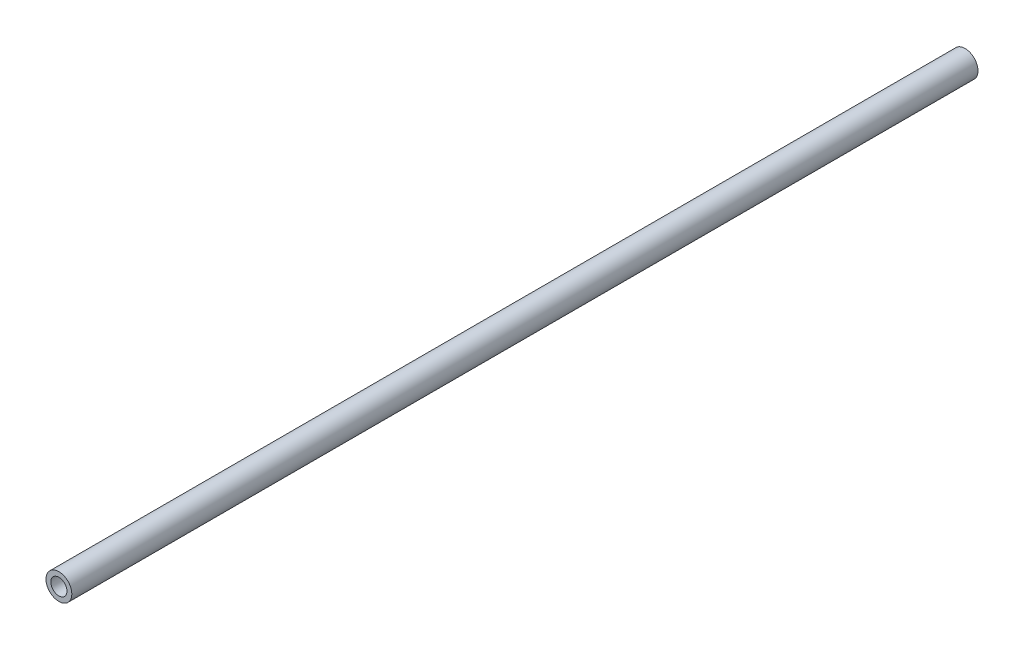
ISO-10303-21;
HEADER;
FILE_DESCRIPTION(('STEP AP214'),'2;1');
FILE_NAME('part.step','',(''),(''),'','','');
FILE_SCHEMA(('AUTOMOTIVE_DESIGN { 1 0 10303 214 1 1 1 1 }'));
ENDSEC;
DATA;
#1=APPLICATION_CONTEXT('core data for automotive mechanical design processes');
#2=APPLICATION_PROTOCOL_DEFINITION('international standard','automotive_design',2000,#1);
#3=PRODUCT_CONTEXT('',#1,'mechanical');
#4=PRODUCT('Part','Part','',(#3));
#5=PRODUCT_RELATED_PRODUCT_CATEGORY('part','',(#4));
#6=PRODUCT_DEFINITION_FORMATION('','',#4);
#7=PRODUCT_DEFINITION_CONTEXT('part definition',#1,'design');
#8=PRODUCT_DEFINITION('design','',#6,#7);
#9=PRODUCT_DEFINITION_SHAPE('','',#8);
#10=(LENGTH_UNIT() NAMED_UNIT(*) SI_UNIT(.MILLI.,.METRE.));
#11=(NAMED_UNIT(*) PLANE_ANGLE_UNIT() SI_UNIT($,.RADIAN.));
#12=(NAMED_UNIT(*) SI_UNIT($,.STERADIAN.) SOLID_ANGLE_UNIT());
#13=UNCERTAINTY_MEASURE_WITH_UNIT(LENGTH_MEASURE(1.E-05),#10,'distance_accuracy_value','');
#14=(GEOMETRIC_REPRESENTATION_CONTEXT(3) GLOBAL_UNCERTAINTY_ASSIGNED_CONTEXT((#13)) GLOBAL_UNIT_ASSIGNED_CONTEXT((#10,
#11,#12)) REPRESENTATION_CONTEXT('',''));
#15=CARTESIAN_POINT('',(0.,0.,0.));
#16=DIRECTION('',(0.,0.,1.));
#17=DIRECTION('',(1.,0.,0.));
#18=AXIS2_PLACEMENT_3D('',#15,#16,#17);
#19=CARTESIAN_POINT('',(0.,0.,-600.));
#20=DIRECTION('',(0.,0.,1.));
#21=DIRECTION('',(1.,0.,0.));
#22=AXIS2_PLACEMENT_3D('',#19,#20,#21);
#23=CYLINDRICAL_SURFACE('',#22,8.55);
#24=CARTESIAN_POINT('',(0.,0.,-600.));
#25=DIRECTION('',(0.,0.,1.));
#26=DIRECTION('',(1.,0.,0.));
#27=AXIS2_PLACEMENT_3D('',#24,#25,#26);
#28=CIRCLE('',#27,8.55);
#29=CARTESIAN_POINT('',(8.55,0.,-600.));
#30=VERTEX_POINT('',#29);
#31=EDGE_CURVE('E10',#30,#30,#28,.T.);
#32=ORIENTED_EDGE('',*,*,#31,.T.);
#33=EDGE_LOOP('',(#32));
#34=FACE_BOUND('',#33,.T.);
#35=CARTESIAN_POINT('',(0.,0.,0.));
#36=DIRECTION('',(0.,0.,1.));
#37=DIRECTION('',(1.,0.,0.));
#38=AXIS2_PLACEMENT_3D('',#35,#36,#37);
#39=CIRCLE('',#38,8.55);
#40=CARTESIAN_POINT('',(8.55,0.,0.));
#41=VERTEX_POINT('',#40);
#42=EDGE_CURVE('E35',#41,#41,#39,.T.);
#43=ORIENTED_EDGE('',*,*,#42,.F.);
#44=EDGE_LOOP('',(#43));
#45=FACE_BOUND('',#44,.T.);
#46=ADVANCED_FACE('F32',(#34,#45),#23,.T.);
#47=CARTESIAN_POINT('',(0.,0.,-600.));
#48=DIRECTION('',(0.,0.,1.));
#49=DIRECTION('',(1.,0.,0.));
#50=AXIS2_PLACEMENT_3D('',#47,#48,#49);
#51=PLANE('',#50);
#52=CARTESIAN_POINT('',(0.,0.,-600.));
#53=DIRECTION('',(0.,0.,1.));
#54=DIRECTION('',(1.,0.,0.));
#55=AXIS2_PLACEMENT_3D('',#52,#53,#54);
#56=CIRCLE('',#55,5.35);
#57=CARTESIAN_POINT('',(5.35,0.,-600.));
#58=VERTEX_POINT('',#57);
#59=EDGE_CURVE('E42',#58,#58,#56,.T.);
#60=ORIENTED_EDGE('',*,*,#59,.T.);
#61=EDGE_LOOP('',(#60));
#62=FACE_BOUND('',#61,.T.);
#63=ORIENTED_EDGE('',*,*,#31,.F.);
#64=EDGE_LOOP('',(#63));
#65=FACE_BOUND('',#64,.T.);
#66=ADVANCED_FACE('F50',(#62,#65),#51,.F.);
#67=CARTESIAN_POINT('',(0.,0.,0.));
#68=DIRECTION('',(0.,0.,1.));
#69=DIRECTION('',(1.,0.,0.));
#70=AXIS2_PLACEMENT_3D('',#67,#68,#69);
#71=PLANE('',#70);
#72=CARTESIAN_POINT('',(0.,0.,0.));
#73=DIRECTION('',(0.,0.,1.));
#74=DIRECTION('',(1.,0.,0.));
#75=AXIS2_PLACEMENT_3D('',#72,#73,#74);
#76=CIRCLE('',#75,5.35);
#77=CARTESIAN_POINT('',(5.35,0.,0.));
#78=VERTEX_POINT('',#77);
#79=EDGE_CURVE('E44',#78,#78,#76,.T.);
#80=ORIENTED_EDGE('',*,*,#79,.F.);
#81=EDGE_LOOP('',(#80));
#82=FACE_BOUND('',#81,.T.);
#83=ORIENTED_EDGE('',*,*,#42,.T.);
#84=EDGE_LOOP('',(#83));
#85=FACE_BOUND('',#84,.T.);
#86=ADVANCED_FACE('F56',(#82,#85),#71,.T.);
#87=CARTESIAN_POINT('',(0.,0.,-600.));
#88=DIRECTION('',(0.,0.,1.));
#89=DIRECTION('',(1.,0.,0.));
#90=AXIS2_PLACEMENT_3D('',#87,#88,#89);
#91=CYLINDRICAL_SURFACE('',#90,5.35);
#92=ORIENTED_EDGE('',*,*,#59,.F.);
#93=EDGE_LOOP('',(#92));
#94=FACE_BOUND('',#93,.T.);
#95=ORIENTED_EDGE('',*,*,#79,.T.);
#96=EDGE_LOOP('',(#95));
#97=FACE_BOUND('',#96,.T.);
#98=ADVANCED_FACE('F53',(#94,#97),#91,.F.);
#99=CLOSED_SHELL('',(#46,#66,#86,#98));
#100=MANIFOLD_SOLID_BREP('B2',#99);
#101=ADVANCED_BREP_SHAPE_REPRESENTATION('',(#18,#100),#14);
#102=SHAPE_DEFINITION_REPRESENTATION(#9,#101);
ENDSEC;
END-ISO-10303-21;
